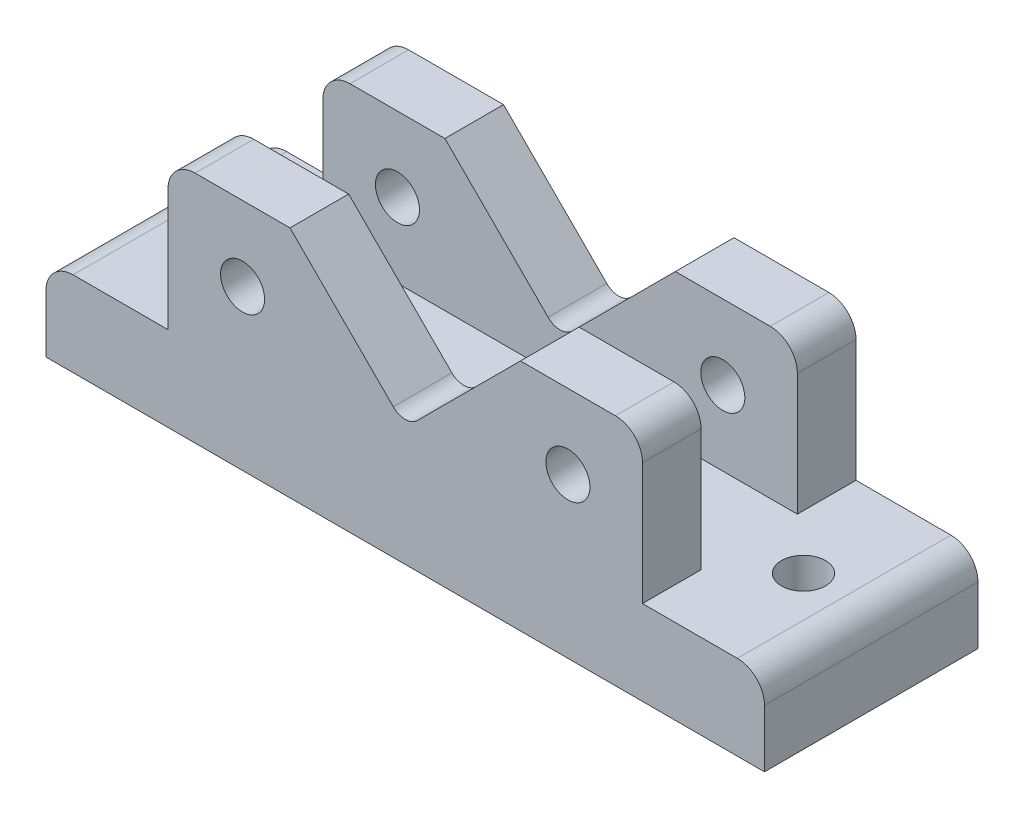
ISO-10303-21;
HEADER;
FILE_DESCRIPTION(('STEP AP214'),'2;1');
FILE_NAME('part.step','',(''),(''),'','','');
FILE_SCHEMA(('AUTOMOTIVE_DESIGN { 1 0 10303 214 1 1 1 1 }'));
ENDSEC;
DATA;
#1=APPLICATION_CONTEXT('core data for automotive mechanical design processes');
#2=APPLICATION_PROTOCOL_DEFINITION('international standard','automotive_design',2000,#1);
#3=PRODUCT_CONTEXT('',#1,'mechanical');
#4=PRODUCT('Part','Part','',(#3));
#5=PRODUCT_RELATED_PRODUCT_CATEGORY('part','',(#4));
#6=PRODUCT_DEFINITION_FORMATION('','',#4);
#7=PRODUCT_DEFINITION_CONTEXT('part definition',#1,'design');
#8=PRODUCT_DEFINITION('design','',#6,#7);
#9=PRODUCT_DEFINITION_SHAPE('','',#8);
#10=(LENGTH_UNIT() NAMED_UNIT(*) SI_UNIT(.MILLI.,.METRE.));
#11=(NAMED_UNIT(*) PLANE_ANGLE_UNIT() SI_UNIT($,.RADIAN.));
#12=(NAMED_UNIT(*) SI_UNIT($,.STERADIAN.) SOLID_ANGLE_UNIT());
#13=UNCERTAINTY_MEASURE_WITH_UNIT(LENGTH_MEASURE(1.E-05),#10,'distance_accuracy_value','');
#14=(GEOMETRIC_REPRESENTATION_CONTEXT(3) GLOBAL_UNCERTAINTY_ASSIGNED_CONTEXT((#13)) GLOBAL_UNIT_ASSIGNED_CONTEXT((#10,
#11,#12)) REPRESENTATION_CONTEXT('',''));
#15=CARTESIAN_POINT('',(0.,0.,0.));
#16=DIRECTION('',(0.,0.,1.));
#17=DIRECTION('',(1.,0.,0.));
#18=AXIS2_PLACEMENT_3D('',#15,#16,#17);
#19=CARTESIAN_POINT('',(0.,25.,0.));
#20=DIRECTION('',(0.,1.,0.));
#21=DIRECTION('',(0.,0.,1.));
#22=AXIS2_PLACEMENT_3D('',#19,#20,#21);
#23=PLANE('',#22);
#24=CARTESIAN_POINT('',(86.,25.,0.));
#25=DIRECTION('',(0.,1.,0.));
#26=DIRECTION('',(0.,0.,1.));
#27=AXIS2_PLACEMENT_3D('',#24,#25,#26);
#28=CIRCLE('',#27,6.5);
#29=CARTESIAN_POINT('',(86.,25.,6.5));
#30=VERTEX_POINT('',#29);
#31=EDGE_CURVE('E433',#30,#30,#28,.T.);
#32=ORIENTED_EDGE('',*,*,#31,.F.);
#33=EDGE_LOOP('',(#32));
#34=FACE_BOUND('',#33,.T.);
#35=CARTESIAN_POINT('',(-86.,25.,1.50704724731259E-13));
#36=DIRECTION('',(0.,1.,0.));
#37=DIRECTION('',(0.,0.,-1.));
#38=AXIS2_PLACEMENT_3D('',#35,#36,#37);
#39=CIRCLE('',#38,6.5);
#40=CARTESIAN_POINT('',(-86.,25.,-6.49999999999985));
#41=VERTEX_POINT('',#40);
#42=EDGE_CURVE('E425',#41,#41,#39,.T.);
#43=ORIENTED_EDGE('',*,*,#42,.F.);
#44=EDGE_LOOP('',(#43));
#45=FACE_BOUND('',#44,.T.);
#46=DIRECTION('',(-1.,0.,0.));
#47=VECTOR('',#46,1.);
#48=CARTESIAN_POINT('',(-106.,25.,-31.5));
#49=LINE('',#48,#47);
#50=CARTESIAN_POINT('',(-70.,25.,-31.5));
#51=VERTEX_POINT('',#50);
#52=CARTESIAN_POINT('',(-98.,25.,-31.5));
#53=VERTEX_POINT('',#52);
#54=EDGE_CURVE('E445',#51,#53,#49,.T.);
#55=ORIENTED_EDGE('',*,*,#54,.T.);
#56=DIRECTION('',(0.,0.,1.));
#57=VECTOR('',#56,1.);
#58=CARTESIAN_POINT('',(-98.,25.,31.5));
#59=LINE('',#58,#57);
#60=CARTESIAN_POINT('',(-98.,25.,31.5));
#61=VERTEX_POINT('',#60);
#62=EDGE_CURVE('E480',#53,#61,#59,.T.);
#63=ORIENTED_EDGE('',*,*,#62,.T.);
#64=DIRECTION('',(1.,0.,0.));
#65=VECTOR('',#64,1.);
#66=CARTESIAN_POINT('',(-106.,25.,31.5));
#67=LINE('',#66,#65);
#68=CARTESIAN_POINT('',(-70.,25.,31.5));
#69=VERTEX_POINT('',#68);
#70=EDGE_CURVE('E446',#61,#69,#67,.T.);
#71=ORIENTED_EDGE('',*,*,#70,.T.);
#72=DIRECTION('',(0.,0.,1.));
#73=VECTOR('',#72,1.);
#74=CARTESIAN_POINT('',(-70.,25.,14.2));
#75=LINE('',#74,#73);
#76=CARTESIAN_POINT('',(-70.,25.,14.2));
#77=VERTEX_POINT('',#76);
#78=EDGE_CURVE('E368',#77,#69,#75,.T.);
#79=ORIENTED_EDGE('',*,*,#78,.F.);
#80=DIRECTION('',(1.,0.,0.));
#81=VECTOR('',#80,1.);
#82=CARTESIAN_POINT('',(-70.,25.,14.2));
#83=LINE('',#82,#81);
#84=CARTESIAN_POINT('',(70.,25.,14.2));
#85=VERTEX_POINT('',#84);
#86=EDGE_CURVE('E336',#77,#85,#83,.T.);
#87=ORIENTED_EDGE('',*,*,#86,.T.);
#88=DIRECTION('',(0.,0.,1.));
#89=VECTOR('',#88,1.);
#90=CARTESIAN_POINT('',(70.,25.,14.2));
#91=LINE('',#90,#89);
#92=CARTESIAN_POINT('',(70.,25.,31.5));
#93=VERTEX_POINT('',#92);
#94=EDGE_CURVE('E418',#85,#93,#91,.T.);
#95=ORIENTED_EDGE('',*,*,#94,.T.);
#96=CARTESIAN_POINT('',(98.,25.,31.5));
#97=VERTEX_POINT('',#96);
#98=EDGE_CURVE('E444',#93,#97,#67,.T.);
#99=ORIENTED_EDGE('',*,*,#98,.T.);
#100=DIRECTION('',(0.,0.,-1.));
#101=VECTOR('',#100,1.);
#102=CARTESIAN_POINT('',(98.,25.,-31.5));
#103=LINE('',#102,#101);
#104=CARTESIAN_POINT('',(98.,25.,-31.5));
#105=VERTEX_POINT('',#104);
#106=EDGE_CURVE('E476',#97,#105,#103,.T.);
#107=ORIENTED_EDGE('',*,*,#106,.T.);
#108=CARTESIAN_POINT('',(70.,25.,-31.5));
#109=VERTEX_POINT('',#108);
#110=EDGE_CURVE('E441',#105,#109,#49,.T.);
#111=ORIENTED_EDGE('',*,*,#110,.T.);
#112=DIRECTION('',(0.,0.,-1.));
#113=VECTOR('',#112,1.);
#114=CARTESIAN_POINT('',(70.,25.,-14.2));
#115=LINE('',#114,#113);
#116=CARTESIAN_POINT('',(70.,25.,-14.2));
#117=VERTEX_POINT('',#116);
#118=EDGE_CURVE('E294',#117,#109,#115,.T.);
#119=ORIENTED_EDGE('',*,*,#118,.F.);
#120=DIRECTION('',(1.,0.,0.));
#121=VECTOR('',#120,1.);
#122=CARTESIAN_POINT('',(-70.,25.,-14.2));
#123=LINE('',#122,#121);
#124=CARTESIAN_POINT('',(-70.,25.,-14.2));
#125=VERTEX_POINT('',#124);
#126=EDGE_CURVE('E237',#125,#117,#123,.T.);
#127=ORIENTED_EDGE('',*,*,#126,.F.);
#128=DIRECTION('',(0.,0.,-1.));
#129=VECTOR('',#128,1.);
#130=CARTESIAN_POINT('',(-70.,25.,-14.2));
#131=LINE('',#130,#129);
#132=EDGE_CURVE('E241',#125,#51,#131,.T.);
#133=ORIENTED_EDGE('',*,*,#132,.T.);
#134=EDGE_LOOP('',(#55,#63,#71,#79,#87,#95,#99,#107,#111,#119,#127,#133));
#135=FACE_BOUND('',#134,.T.);
#136=ADVANCED_FACE('F38',(#34,#45,#135),#23,.T.);
#137=CARTESIAN_POINT('',(0.,0.,0.));
#138=DIRECTION('',(0.,1.,0.));
#139=DIRECTION('',(0.,0.,1.));
#140=AXIS2_PLACEMENT_3D('',#137,#138,#139);
#141=PLANE('',#140);
#142=DIRECTION('',(0.,0.,-1.));
#143=VECTOR('',#142,1.);
#144=CARTESIAN_POINT('',(106.,0.,-31.5));
#145=LINE('',#144,#143);
#146=CARTESIAN_POINT('',(106.,0.,31.5));
#147=VERTEX_POINT('',#146);
#148=CARTESIAN_POINT('',(106.,0.,-31.5));
#149=VERTEX_POINT('',#148);
#150=EDGE_CURVE('E437',#147,#149,#145,.T.);
#151=ORIENTED_EDGE('',*,*,#150,.F.);
#152=DIRECTION('',(1.,0.,0.));
#153=VECTOR('',#152,1.);
#154=CARTESIAN_POINT('',(-106.,0.,31.5));
#155=LINE('',#154,#153);
#156=CARTESIAN_POINT('',(-106.,0.,31.5));
#157=VERTEX_POINT('',#156);
#158=EDGE_CURVE('E461',#157,#147,#155,.T.);
#159=ORIENTED_EDGE('',*,*,#158,.F.);
#160=DIRECTION('',(0.,0.,1.));
#161=VECTOR('',#160,1.);
#162=CARTESIAN_POINT('',(-106.,0.,-31.5));
#163=LINE('',#162,#161);
#164=CARTESIAN_POINT('',(-106.,0.,-31.5));
#165=VERTEX_POINT('',#164);
#166=EDGE_CURVE('E457',#165,#157,#163,.T.);
#167=ORIENTED_EDGE('',*,*,#166,.F.);
#168=DIRECTION('',(-1.,0.,0.));
#169=VECTOR('',#168,1.);
#170=CARTESIAN_POINT('',(-106.,0.,-31.5));
#171=LINE('',#170,#169);
#172=EDGE_CURVE('E453',#149,#165,#171,.T.);
#173=ORIENTED_EDGE('',*,*,#172,.F.);
#174=EDGE_LOOP('',(#151,#159,#167,#173));
#175=FACE_BOUND('',#174,.T.);
#176=CARTESIAN_POINT('',(86.,0.,0.));
#177=DIRECTION('',(0.,1.,0.));
#178=DIRECTION('',(0.,0.,1.));
#179=AXIS2_PLACEMENT_3D('',#176,#177,#178);
#180=CIRCLE('',#179,6.5);
#181=CARTESIAN_POINT('',(86.,0.,6.5));
#182=VERTEX_POINT('',#181);
#183=EDGE_CURVE('E429',#182,#182,#180,.T.);
#184=ORIENTED_EDGE('',*,*,#183,.T.);
#185=EDGE_LOOP('',(#184));
#186=FACE_BOUND('',#185,.T.);
#187=CARTESIAN_POINT('',(-86.,0.,1.50704724731259E-13));
#188=DIRECTION('',(0.,1.,0.));
#189=DIRECTION('',(0.,0.,-1.));
#190=AXIS2_PLACEMENT_3D('',#187,#188,#189);
#191=CIRCLE('',#190,6.5);
#192=CARTESIAN_POINT('',(-86.,0.,-6.49999999999985));
#193=VERTEX_POINT('',#192);
#194=EDGE_CURVE('E401',#193,#193,#191,.T.);
#195=ORIENTED_EDGE('',*,*,#194,.T.);
#196=EDGE_LOOP('',(#195));
#197=FACE_BOUND('',#196,.T.);
#198=ADVANCED_FACE('F544',(#175,#186,#197),#141,.F.);
#199=CARTESIAN_POINT('',(106.,25.,-31.5));
#200=DIRECTION('',(-1.,0.,0.));
#201=DIRECTION('',(0.,0.,1.));
#202=AXIS2_PLACEMENT_3D('',#199,#200,#201);
#203=PLANE('',#202);
#204=DIRECTION('',(0.,-1.,0.));
#205=VECTOR('',#204,1.);
#206=CARTESIAN_POINT('',(106.,25.,-31.5));
#207=LINE('',#206,#205);
#208=CARTESIAN_POINT('',(106.,17.,-31.5));
#209=VERTEX_POINT('',#208);
#210=EDGE_CURVE('E473',#209,#149,#207,.T.);
#211=ORIENTED_EDGE('',*,*,#210,.F.);
#212=DIRECTION('',(0.,0.,-1.));
#213=VECTOR('',#212,1.);
#214=CARTESIAN_POINT('',(106.,17.,31.5));
#215=LINE('',#214,#213);
#216=CARTESIAN_POINT('',(106.,17.,31.5));
#217=VERTEX_POINT('',#216);
#218=EDGE_CURVE('E499',#209,#217,#215,.F.);
#219=ORIENTED_EDGE('',*,*,#218,.T.);
#220=DIRECTION('',(0.,-1.,0.));
#221=VECTOR('',#220,1.);
#222=CARTESIAN_POINT('',(106.,25.,31.5));
#223=LINE('',#222,#221);
#224=EDGE_CURVE('E449',#217,#147,#223,.T.);
#225=ORIENTED_EDGE('',*,*,#224,.T.);
#226=ORIENTED_EDGE('',*,*,#150,.T.);
#227=EDGE_LOOP('',(#211,#219,#225,#226));
#228=FACE_BOUND('',#227,.T.);
#229=ADVANCED_FACE('F592',(#228),#203,.F.);
#230=CARTESIAN_POINT('',(-106.,25.,-31.5));
#231=DIRECTION('',(0.,0.,1.));
#232=DIRECTION('',(1.,0.,0.));
#233=AXIS2_PLACEMENT_3D('',#230,#231,#232);
#234=PLANE('',#233);
#235=DIRECTION('',(0.,-1.,0.));
#236=VECTOR('',#235,1.);
#237=CARTESIAN_POINT('',(-106.,25.,-31.5));
#238=LINE('',#237,#236);
#239=CARTESIAN_POINT('',(-106.,17.,-31.5));
#240=VERTEX_POINT('',#239);
#241=EDGE_CURVE('E470',#240,#165,#238,.T.);
#242=ORIENTED_EDGE('',*,*,#241,.F.);
#243=CARTESIAN_POINT('',(-98.,17.,-31.5));
#244=DIRECTION('',(0.,0.,1.));
#245=DIRECTION('',(1.,0.,0.));
#246=AXIS2_PLACEMENT_3D('',#243,#244,#245);
#247=CIRCLE('',#246,8.);
#248=EDGE_CURVE('E496',#240,#53,#247,.F.);
#249=ORIENTED_EDGE('',*,*,#248,.T.);
#250=ORIENTED_EDGE('',*,*,#54,.F.);
#251=DIRECTION('',(0.,-1.,0.));
#252=VECTOR('',#251,1.);
#253=CARTESIAN_POINT('',(-70.,25.,-31.5));
#254=LINE('',#253,#252);
#255=CARTESIAN_POINT('',(-70.,61.,-31.5));
#256=VERTEX_POINT('',#255);
#257=EDGE_CURVE('E271',#256,#51,#254,.T.);
#258=ORIENTED_EDGE('',*,*,#257,.F.);
#259=CARTESIAN_POINT('',(-62.,61.,-31.5));
#260=DIRECTION('',(0.,0.,1.));
#261=DIRECTION('',(1.,0.,0.));
#262=AXIS2_PLACEMENT_3D('',#259,#260,#261);
#263=CIRCLE('',#262,8.);
#264=CARTESIAN_POINT('',(-61.9999999999999,69.,-31.5));
#265=VERTEX_POINT('',#264);
#266=EDGE_CURVE('E231',#265,#256,#263,.T.);
#267=ORIENTED_EDGE('',*,*,#266,.F.);
#268=DIRECTION('',(-1.,0.,0.));
#269=VECTOR('',#268,1.);
#270=CARTESIAN_POINT('',(-61.9999999999999,69.,-31.5));
#271=LINE('',#270,#269);
#272=CARTESIAN_POINT('',(-34.,69.,-31.5));
#273=VERTEX_POINT('',#272);
#274=EDGE_CURVE('E277',#273,#265,#271,.T.);
#275=ORIENTED_EDGE('',*,*,#274,.F.);
#276=DIRECTION('',(-0.707106781186544,0.707106781186551,0.));
#277=VECTOR('',#276,1.);
#278=CARTESIAN_POINT('',(-34.,69.,-31.5));
#279=LINE('',#278,#277);
#280=CARTESIAN_POINT('',(-3.53553390593276,38.5355339059324,-31.5));
#281=VERTEX_POINT('',#280);
#282=EDGE_CURVE('E280',#281,#273,#279,.T.);
#283=ORIENTED_EDGE('',*,*,#282,.F.);
#284=CARTESIAN_POINT('',(0.,42.0710678118651,-31.5));
#285=DIRECTION('',(0.,0.,1.));
#286=DIRECTION('',(1.,0.,0.));
#287=AXIS2_PLACEMENT_3D('',#284,#285,#286);
#288=CIRCLE('',#287,5.);
#289=CARTESIAN_POINT('',(3.53553390593276,38.5355339059324,-31.5));
#290=VERTEX_POINT('',#289);
#291=EDGE_CURVE('E47',#281,#290,#288,.T.);
#292=ORIENTED_EDGE('',*,*,#291,.T.);
#293=DIRECTION('',(-0.707106781186544,-0.707106781186551,0.));
#294=VECTOR('',#293,1.);
#295=CARTESIAN_POINT('',(34.,69.,-31.5));
#296=LINE('',#295,#294);
#297=CARTESIAN_POINT('',(34.,69.,-31.5));
#298=VERTEX_POINT('',#297);
#299=EDGE_CURVE('E283',#298,#290,#296,.T.);
#300=ORIENTED_EDGE('',*,*,#299,.F.);
#301=DIRECTION('',(-1.,0.,0.));
#302=VECTOR('',#301,1.);
#303=CARTESIAN_POINT('',(61.9999999999999,69.,-31.5));
#304=LINE('',#303,#302);
#305=CARTESIAN_POINT('',(61.9999999999999,69.,-31.5));
#306=VERTEX_POINT('',#305);
#307=EDGE_CURVE('E286',#306,#298,#304,.T.);
#308=ORIENTED_EDGE('',*,*,#307,.F.);
#309=CARTESIAN_POINT('',(62.,61.,-31.5));
#310=DIRECTION('',(0.,0.,1.));
#311=DIRECTION('',(-1.,0.,0.));
#312=AXIS2_PLACEMENT_3D('',#309,#310,#311);
#313=CIRCLE('',#312,8.);
#314=CARTESIAN_POINT('',(70.,61.,-31.5));
#315=VERTEX_POINT('',#314);
#316=EDGE_CURVE('E246',#315,#306,#313,.T.);
#317=ORIENTED_EDGE('',*,*,#316,.F.);
#318=DIRECTION('',(0.,1.,0.));
#319=VECTOR('',#318,1.);
#320=CARTESIAN_POINT('',(70.,25.,-31.5));
#321=LINE('',#320,#319);
#322=EDGE_CURVE('E243',#109,#315,#321,.T.);
#323=ORIENTED_EDGE('',*,*,#322,.F.);
#324=ORIENTED_EDGE('',*,*,#110,.F.);
#325=CARTESIAN_POINT('',(98.,17.,-31.5));
#326=DIRECTION('',(0.,0.,1.));
#327=DIRECTION('',(1.,0.,0.));
#328=AXIS2_PLACEMENT_3D('',#325,#326,#327);
#329=CIRCLE('',#328,8.);
#330=EDGE_CURVE('E493',#105,#209,#329,.F.);
#331=ORIENTED_EDGE('',*,*,#330,.T.);
#332=ORIENTED_EDGE('',*,*,#210,.T.);
#333=ORIENTED_EDGE('',*,*,#172,.T.);
#334=EDGE_LOOP('',(#242,#249,#250,#258,#267,#275,#283,#292,#300,#308,#317,#323,#324,#331,#332,#333));
#335=FACE_BOUND('',#334,.T.);
#336=CARTESIAN_POINT('',(-48.,47.,-31.5));
#337=DIRECTION('',(0.,0.,1.));
#338=DIRECTION('',(1.,0.,0.));
#339=AXIS2_PLACEMENT_3D('',#336,#337,#338);
#340=CIRCLE('',#339,6.5);
#341=CARTESIAN_POINT('',(-41.5,47.,-31.5));
#342=VERTEX_POINT('',#341);
#343=EDGE_CURVE('E249',#342,#342,#340,.T.);
#344=ORIENTED_EDGE('',*,*,#343,.T.);
#345=EDGE_LOOP('',(#344));
#346=FACE_BOUND('',#345,.T.);
#347=CARTESIAN_POINT('',(48.,47.,-31.5));
#348=DIRECTION('',(0.,0.,1.));
#349=DIRECTION('',(-1.,0.,0.));
#350=AXIS2_PLACEMENT_3D('',#347,#348,#349);
#351=CIRCLE('',#350,6.5);
#352=CARTESIAN_POINT('',(41.5,47.,-31.5));
#353=VERTEX_POINT('',#352);
#354=EDGE_CURVE('E933',#353,#353,#351,.T.);
#355=ORIENTED_EDGE('',*,*,#354,.T.);
#356=EDGE_LOOP('',(#355));
#357=FACE_BOUND('',#356,.T.);
#358=ADVANCED_FACE('F556',(#335,#346,#357),#234,.F.);
#359=CARTESIAN_POINT('',(-106.,25.,-31.5));
#360=DIRECTION('',(1.,0.,0.));
#361=DIRECTION('',(0.,0.,-1.));
#362=AXIS2_PLACEMENT_3D('',#359,#360,#361);
#363=PLANE('',#362);
#364=DIRECTION('',(0.,-1.,0.));
#365=VECTOR('',#364,1.);
#366=CARTESIAN_POINT('',(-106.,25.,31.5));
#367=LINE('',#366,#365);
#368=CARTESIAN_POINT('',(-106.,17.,31.5));
#369=VERTEX_POINT('',#368);
#370=EDGE_CURVE('E467',#369,#157,#367,.T.);
#371=ORIENTED_EDGE('',*,*,#370,.F.);
#372=DIRECTION('',(0.,0.,1.));
#373=VECTOR('',#372,1.);
#374=CARTESIAN_POINT('',(-106.,17.,-31.5));
#375=LINE('',#374,#373);
#376=EDGE_CURVE('E490',#369,#240,#375,.F.);
#377=ORIENTED_EDGE('',*,*,#376,.T.);
#378=ORIENTED_EDGE('',*,*,#241,.T.);
#379=ORIENTED_EDGE('',*,*,#166,.T.);
#380=EDGE_LOOP('',(#371,#377,#378,#379));
#381=FACE_BOUND('',#380,.T.);
#382=ADVANCED_FACE('F537',(#381),#363,.F.);
#383=CARTESIAN_POINT('',(-106.,25.,31.5));
#384=DIRECTION('',(0.,0.,-1.));
#385=DIRECTION('',(-1.,0.,0.));
#386=AXIS2_PLACEMENT_3D('',#383,#384,#385);
#387=PLANE('',#386);
#388=ORIENTED_EDGE('',*,*,#70,.F.);
#389=CARTESIAN_POINT('',(-98.,17.,31.5));
#390=DIRECTION('',(0.,0.,-1.));
#391=DIRECTION('',(-1.,0.,0.));
#392=AXIS2_PLACEMENT_3D('',#389,#390,#391);
#393=CIRCLE('',#392,8.);
#394=EDGE_CURVE('E487',#61,#369,#393,.F.);
#395=ORIENTED_EDGE('',*,*,#394,.T.);
#396=ORIENTED_EDGE('',*,*,#370,.T.);
#397=ORIENTED_EDGE('',*,*,#158,.T.);
#398=ORIENTED_EDGE('',*,*,#224,.F.);
#399=CARTESIAN_POINT('',(98.,17.,31.5));
#400=DIRECTION('',(0.,0.,-1.));
#401=DIRECTION('',(-1.,0.,0.));
#402=AXIS2_PLACEMENT_3D('',#399,#400,#401);
#403=CIRCLE('',#402,8.);
#404=EDGE_CURVE('E484',#217,#97,#403,.F.);
#405=ORIENTED_EDGE('',*,*,#404,.T.);
#406=ORIENTED_EDGE('',*,*,#98,.F.);
#407=DIRECTION('',(0.,1.,0.));
#408=VECTOR('',#407,1.);
#409=CARTESIAN_POINT('',(70.,25.,31.5));
#410=LINE('',#409,#408);
#411=CARTESIAN_POINT('',(70.,61.,31.5));
#412=VERTEX_POINT('',#411);
#413=EDGE_CURVE('E372',#93,#412,#410,.T.);
#414=ORIENTED_EDGE('',*,*,#413,.T.);
#415=CARTESIAN_POINT('',(62.,61.,31.5));
#416=DIRECTION('',(0.,0.,1.));
#417=DIRECTION('',(-1.,0.,0.));
#418=AXIS2_PLACEMENT_3D('',#415,#416,#417);
#419=CIRCLE('',#418,8.);
#420=CARTESIAN_POINT('',(61.9999999999999,69.,31.5));
#421=VERTEX_POINT('',#420);
#422=EDGE_CURVE('E376',#412,#421,#419,.T.);
#423=ORIENTED_EDGE('',*,*,#422,.T.);
#424=DIRECTION('',(-1.,0.,0.));
#425=VECTOR('',#424,1.);
#426=CARTESIAN_POINT('',(61.9999999999999,69.,31.5));
#427=LINE('',#426,#425);
#428=CARTESIAN_POINT('',(34.,69.,31.5));
#429=VERTEX_POINT('',#428);
#430=EDGE_CURVE('E380',#421,#429,#427,.T.);
#431=ORIENTED_EDGE('',*,*,#430,.T.);
#432=DIRECTION('',(-0.707106781186544,-0.707106781186551,0.));
#433=VECTOR('',#432,1.);
#434=CARTESIAN_POINT('',(34.,69.,31.5));
#435=LINE('',#434,#433);
#436=CARTESIAN_POINT('',(3.53553390593276,38.5355339059324,31.5));
#437=VERTEX_POINT('',#436);
#438=EDGE_CURVE('E384',#429,#437,#435,.T.);
#439=ORIENTED_EDGE('',*,*,#438,.T.);
#440=CARTESIAN_POINT('',(0.,42.0710678118651,31.5));
#441=DIRECTION('',(0.,0.,-1.));
#442=DIRECTION('',(-1.,0.,0.));
#443=AXIS2_PLACEMENT_3D('',#440,#441,#442);
#444=CIRCLE('',#443,5.);
#445=CARTESIAN_POINT('',(-3.53553390593276,38.5355339059324,31.5));
#446=VERTEX_POINT('',#445);
#447=EDGE_CURVE('E515',#437,#446,#444,.T.);
#448=ORIENTED_EDGE('',*,*,#447,.T.);
#449=DIRECTION('',(-0.707106781186544,0.707106781186551,0.));
#450=VECTOR('',#449,1.);
#451=CARTESIAN_POINT('',(-34.,69.,31.5));
#452=LINE('',#451,#450);
#453=CARTESIAN_POINT('',(-34.,69.,31.5));
#454=VERTEX_POINT('',#453);
#455=EDGE_CURVE('E388',#446,#454,#452,.T.);
#456=ORIENTED_EDGE('',*,*,#455,.T.);
#457=DIRECTION('',(-1.,0.,0.));
#458=VECTOR('',#457,1.);
#459=CARTESIAN_POINT('',(-61.9999999999999,69.,31.5));
#460=LINE('',#459,#458);
#461=CARTESIAN_POINT('',(-61.9999999999999,69.,31.5));
#462=VERTEX_POINT('',#461);
#463=EDGE_CURVE('E391',#454,#462,#460,.T.);
#464=ORIENTED_EDGE('',*,*,#463,.T.);
#465=CARTESIAN_POINT('',(-62.,61.,31.5));
#466=DIRECTION('',(0.,0.,1.));
#467=DIRECTION('',(1.,0.,0.));
#468=AXIS2_PLACEMENT_3D('',#465,#466,#467);
#469=CIRCLE('',#468,8.);
#470=CARTESIAN_POINT('',(-70.,61.,31.5));
#471=VERTEX_POINT('',#470);
#472=EDGE_CURVE('E337',#462,#471,#469,.T.);
#473=ORIENTED_EDGE('',*,*,#472,.T.);
#474=DIRECTION('',(0.,-1.,0.));
#475=VECTOR('',#474,1.);
#476=CARTESIAN_POINT('',(-70.,25.,31.5));
#477=LINE('',#476,#475);
#478=EDGE_CURVE('E328',#471,#69,#477,.T.);
#479=ORIENTED_EDGE('',*,*,#478,.T.);
#480=EDGE_LOOP('',(#388,#395,#396,#397,#398,#405,#406,#414,#423,#431,#439,#448,#456,#464,#473,#479));
#481=FACE_BOUND('',#480,.T.);
#482=CARTESIAN_POINT('',(48.,47.,31.5));
#483=DIRECTION('',(0.,0.,1.));
#484=DIRECTION('',(-1.,0.,0.));
#485=AXIS2_PLACEMENT_3D('',#482,#483,#484);
#486=CIRCLE('',#485,6.5);
#487=CARTESIAN_POINT('',(41.5,47.,31.5));
#488=VERTEX_POINT('',#487);
#489=EDGE_CURVE('E293',#488,#488,#486,.T.);
#490=ORIENTED_EDGE('',*,*,#489,.F.);
#491=EDGE_LOOP('',(#490));
#492=FACE_BOUND('',#491,.T.);
#493=CARTESIAN_POINT('',(-48.,47.,31.5));
#494=DIRECTION('',(0.,0.,1.));
#495=DIRECTION('',(1.,0.,0.));
#496=AXIS2_PLACEMENT_3D('',#493,#494,#495);
#497=CIRCLE('',#496,6.5);
#498=CARTESIAN_POINT('',(-41.5,47.,31.5));
#499=VERTEX_POINT('',#498);
#500=EDGE_CURVE('E320',#499,#499,#497,.T.);
#501=ORIENTED_EDGE('',*,*,#500,.F.);
#502=EDGE_LOOP('',(#501));
#503=FACE_BOUND('',#502,.T.);
#504=ADVANCED_FACE('F534',(#481,#492,#503),#387,.F.);
#505=CARTESIAN_POINT('',(86.,25.,0.));
#506=DIRECTION('',(0.,-1.,0.));
#507=DIRECTION('',(0.,0.,-1.));
#508=AXIS2_PLACEMENT_3D('',#505,#506,#507);
#509=CYLINDRICAL_SURFACE('',#508,6.5);
#510=ORIENTED_EDGE('',*,*,#31,.T.);
#511=EDGE_LOOP('',(#510));
#512=FACE_BOUND('',#511,.T.);
#513=ORIENTED_EDGE('',*,*,#183,.F.);
#514=EDGE_LOOP('',(#513));
#515=FACE_BOUND('',#514,.T.);
#516=ADVANCED_FACE('F597',(#512,#515),#509,.F.);
#517=CARTESIAN_POINT('',(-86.,25.,1.50704724731259E-13));
#518=DIRECTION('',(0.,-1.,0.));
#519=DIRECTION('',(0.,0.,-1.));
#520=AXIS2_PLACEMENT_3D('',#517,#518,#519);
#521=CYLINDRICAL_SURFACE('',#520,6.5);
#522=ORIENTED_EDGE('',*,*,#42,.T.);
#523=EDGE_LOOP('',(#522));
#524=FACE_BOUND('',#523,.T.);
#525=ORIENTED_EDGE('',*,*,#194,.F.);
#526=EDGE_LOOP('',(#525));
#527=FACE_BOUND('',#526,.T.);
#528=ADVANCED_FACE('F674',(#524,#527),#521,.F.);
#529=CARTESIAN_POINT('',(-70.,25.,14.2));
#530=DIRECTION('',(-1.,0.,0.));
#531=DIRECTION('',(0.,-1.,0.));
#532=AXIS2_PLACEMENT_3D('',#529,#530,#531);
#533=PLANE('',#532);
#534=ORIENTED_EDGE('',*,*,#478,.F.);
#535=DIRECTION('',(0.,0.,1.));
#536=VECTOR('',#535,1.);
#537=CARTESIAN_POINT('',(-70.,61.,14.2));
#538=LINE('',#537,#536);
#539=CARTESIAN_POINT('',(-70.,61.,14.2));
#540=VERTEX_POINT('',#539);
#541=EDGE_CURVE('E398',#540,#471,#538,.T.);
#542=ORIENTED_EDGE('',*,*,#541,.F.);
#543=DIRECTION('',(0.,-1.,0.));
#544=VECTOR('',#543,1.);
#545=CARTESIAN_POINT('',(-70.,25.,14.2));
#546=LINE('',#545,#544);
#547=EDGE_CURVE('E332',#540,#77,#546,.T.);
#548=ORIENTED_EDGE('',*,*,#547,.T.);
#549=ORIENTED_EDGE('',*,*,#78,.T.);
#550=EDGE_LOOP('',(#534,#542,#548,#549));
#551=FACE_BOUND('',#550,.T.);
#552=ADVANCED_FACE('F645',(#551),#533,.T.);
#553=CARTESIAN_POINT('',(-62.,61.,14.2));
#554=DIRECTION('',(0.,0.,1.));
#555=DIRECTION('',(1.,0.,0.));
#556=AXIS2_PLACEMENT_3D('',#553,#554,#555);
#557=CYLINDRICAL_SURFACE('',#556,8.);
#558=ORIENTED_EDGE('',*,*,#472,.F.);
#559=DIRECTION('',(0.,0.,1.));
#560=VECTOR('',#559,1.);
#561=CARTESIAN_POINT('',(-61.9999999999999,69.,14.2));
#562=LINE('',#561,#560);
#563=CARTESIAN_POINT('',(-61.9999999999999,69.,14.2));
#564=VERTEX_POINT('',#563);
#565=EDGE_CURVE('E402',#564,#462,#562,.T.);
#566=ORIENTED_EDGE('',*,*,#565,.F.);
#567=CARTESIAN_POINT('',(-62.,61.,14.2));
#568=DIRECTION('',(0.,0.,1.));
#569=DIRECTION('',(1.,0.,0.));
#570=AXIS2_PLACEMENT_3D('',#567,#568,#569);
#571=CIRCLE('',#570,8.);
#572=EDGE_CURVE('E364',#564,#540,#571,.T.);
#573=ORIENTED_EDGE('',*,*,#572,.T.);
#574=ORIENTED_EDGE('',*,*,#541,.T.);
#575=EDGE_LOOP('',(#558,#566,#573,#574));
#576=FACE_BOUND('',#575,.T.);
#577=ADVANCED_FACE('F649',(#576),#557,.T.);
#578=CARTESIAN_POINT('',(-61.9999999999999,69.,14.2));
#579=DIRECTION('',(0.,1.,0.));
#580=DIRECTION('',(0.,0.,1.));
#581=AXIS2_PLACEMENT_3D('',#578,#579,#580);
#582=PLANE('',#581);
#583=ORIENTED_EDGE('',*,*,#463,.F.);
#584=DIRECTION('',(0.,0.,1.));
#585=VECTOR('',#584,1.);
#586=CARTESIAN_POINT('',(-34.,69.,14.2));
#587=LINE('',#586,#585);
#588=CARTESIAN_POINT('',(-34.,69.,14.2));
#589=VERTEX_POINT('',#588);
#590=EDGE_CURVE('E405',#589,#454,#587,.T.);
#591=ORIENTED_EDGE('',*,*,#590,.F.);
#592=DIRECTION('',(-1.,0.,0.));
#593=VECTOR('',#592,1.);
#594=CARTESIAN_POINT('',(-61.9999999999999,69.,14.2));
#595=LINE('',#594,#593);
#596=EDGE_CURVE('E360',#589,#564,#595,.T.);
#597=ORIENTED_EDGE('',*,*,#596,.T.);
#598=ORIENTED_EDGE('',*,*,#565,.T.);
#599=EDGE_LOOP('',(#583,#591,#597,#598));
#600=FACE_BOUND('',#599,.T.);
#601=ADVANCED_FACE('F653',(#600),#582,.T.);
#602=CARTESIAN_POINT('',(-34.,69.,14.2));
#603=DIRECTION('',(0.707106781186551,0.707106781186544,0.));
#604=DIRECTION('',(-0.707106781186544,0.707106781186551,0.));
#605=AXIS2_PLACEMENT_3D('',#602,#603,#604);
#606=PLANE('',#605);
#607=ORIENTED_EDGE('',*,*,#455,.F.);
#608=DIRECTION('',(0.,0.,1.));
#609=VECTOR('',#608,1.);
#610=CARTESIAN_POINT('',(-3.53553390593276,38.5355339059324,14.2));
#611=LINE('',#610,#609);
#612=CARTESIAN_POINT('',(-3.53553390593276,38.5355339059324,14.2));
#613=VERTEX_POINT('',#612);
#614=EDGE_CURVE('E506',#446,#613,#611,.F.);
#615=ORIENTED_EDGE('',*,*,#614,.T.);
#616=DIRECTION('',(-0.707106781186544,0.707106781186551,0.));
#617=VECTOR('',#616,1.);
#618=CARTESIAN_POINT('',(-34.,69.,14.2));
#619=LINE('',#618,#617);
#620=EDGE_CURVE('E357',#613,#589,#619,.T.);
#621=ORIENTED_EDGE('',*,*,#620,.T.);
#622=ORIENTED_EDGE('',*,*,#590,.T.);
#623=EDGE_LOOP('',(#607,#615,#621,#622));
#624=FACE_BOUND('',#623,.T.);
#625=ADVANCED_FACE('F656',(#624),#606,.T.);
#626=CARTESIAN_POINT('',(34.,69.,14.2));
#627=DIRECTION('',(-0.707106781186551,0.707106781186544,0.));
#628=DIRECTION('',(-0.707106781186544,-0.707106781186551,0.));
#629=AXIS2_PLACEMENT_3D('',#626,#627,#628);
#630=PLANE('',#629);
#631=DIRECTION('',(-0.707106781186544,-0.707106781186551,0.));
#632=VECTOR('',#631,1.);
#633=CARTESIAN_POINT('',(34.,69.,14.2));
#634=LINE('',#633,#632);
#635=CARTESIAN_POINT('',(34.,69.,14.2));
#636=VERTEX_POINT('',#635);
#637=CARTESIAN_POINT('',(3.53553390593276,38.5355339059324,14.2));
#638=VERTEX_POINT('',#637);
#639=EDGE_CURVE('E353',#636,#638,#634,.T.);
#640=ORIENTED_EDGE('',*,*,#639,.T.);
#641=DIRECTION('',(0.,0.,1.));
#642=VECTOR('',#641,1.);
#643=CARTESIAN_POINT('',(3.53553390593277,38.5355339059324,31.5));
#644=LINE('',#643,#642);
#645=EDGE_CURVE('E502',#638,#437,#644,.T.);
#646=ORIENTED_EDGE('',*,*,#645,.T.);
#647=ORIENTED_EDGE('',*,*,#438,.F.);
#648=DIRECTION('',(0.,0.,1.));
#649=VECTOR('',#648,1.);
#650=CARTESIAN_POINT('',(34.,69.,14.2));
#651=LINE('',#650,#649);
#652=EDGE_CURVE('E409',#636,#429,#651,.T.);
#653=ORIENTED_EDGE('',*,*,#652,.F.);
#654=EDGE_LOOP('',(#640,#646,#647,#653));
#655=FACE_BOUND('',#654,.T.);
#656=ADVANCED_FACE('F630',(#655),#630,.T.);
#657=CARTESIAN_POINT('',(61.9999999999999,69.,14.2));
#658=DIRECTION('',(0.,1.,0.));
#659=DIRECTION('',(0.,0.,1.));
#660=AXIS2_PLACEMENT_3D('',#657,#658,#659);
#661=PLANE('',#660);
#662=ORIENTED_EDGE('',*,*,#430,.F.);
#663=DIRECTION('',(0.,0.,1.));
#664=VECTOR('',#663,1.);
#665=CARTESIAN_POINT('',(61.9999999999999,69.,14.2));
#666=LINE('',#665,#664);
#667=CARTESIAN_POINT('',(61.9999999999999,69.,14.2));
#668=VERTEX_POINT('',#667);
#669=EDGE_CURVE('E412',#668,#421,#666,.T.);
#670=ORIENTED_EDGE('',*,*,#669,.F.);
#671=DIRECTION('',(-1.,0.,0.));
#672=VECTOR('',#671,1.);
#673=CARTESIAN_POINT('',(61.9999999999999,69.,14.2));
#674=LINE('',#673,#672);
#675=EDGE_CURVE('E349',#668,#636,#674,.T.);
#676=ORIENTED_EDGE('',*,*,#675,.T.);
#677=ORIENTED_EDGE('',*,*,#652,.T.);
#678=EDGE_LOOP('',(#662,#670,#676,#677));
#679=FACE_BOUND('',#678,.T.);
#680=ADVANCED_FACE('F634',(#679),#661,.T.);
#681=CARTESIAN_POINT('',(62.,61.,14.2));
#682=DIRECTION('',(0.,0.,1.));
#683=DIRECTION('',(1.,0.,0.));
#684=AXIS2_PLACEMENT_3D('',#681,#682,#683);
#685=CYLINDRICAL_SURFACE('',#684,8.);
#686=ORIENTED_EDGE('',*,*,#422,.F.);
#687=DIRECTION('',(0.,0.,1.));
#688=VECTOR('',#687,1.);
#689=CARTESIAN_POINT('',(70.,61.,14.2));
#690=LINE('',#689,#688);
#691=CARTESIAN_POINT('',(70.,61.,14.2));
#692=VERTEX_POINT('',#691);
#693=EDGE_CURVE('E415',#692,#412,#690,.T.);
#694=ORIENTED_EDGE('',*,*,#693,.F.);
#695=CARTESIAN_POINT('',(62.,61.,14.2));
#696=DIRECTION('',(0.,0.,1.));
#697=DIRECTION('',(-1.,0.,0.));
#698=AXIS2_PLACEMENT_3D('',#695,#696,#697);
#699=CIRCLE('',#698,8.);
#700=EDGE_CURVE('E345',#692,#668,#699,.T.);
#701=ORIENTED_EDGE('',*,*,#700,.T.);
#702=ORIENTED_EDGE('',*,*,#669,.T.);
#703=EDGE_LOOP('',(#686,#694,#701,#702));
#704=FACE_BOUND('',#703,.T.);
#705=ADVANCED_FACE('F639',(#704),#685,.T.);
#706=CARTESIAN_POINT('',(70.,25.,14.2));
#707=DIRECTION('',(1.,0.,0.));
#708=DIRECTION('',(0.,1.,0.));
#709=AXIS2_PLACEMENT_3D('',#706,#707,#708);
#710=PLANE('',#709);
#711=ORIENTED_EDGE('',*,*,#413,.F.);
#712=ORIENTED_EDGE('',*,*,#94,.F.);
#713=DIRECTION('',(0.,1.,0.));
#714=VECTOR('',#713,1.);
#715=CARTESIAN_POINT('',(70.,25.,14.2));
#716=LINE('',#715,#714);
#717=EDGE_CURVE('E341',#85,#692,#716,.T.);
#718=ORIENTED_EDGE('',*,*,#717,.T.);
#719=ORIENTED_EDGE('',*,*,#693,.T.);
#720=EDGE_LOOP('',(#711,#712,#718,#719));
#721=FACE_BOUND('',#720,.T.);
#722=ADVANCED_FACE('F641',(#721),#710,.T.);
#723=CARTESIAN_POINT('',(-62.,61.,14.2));
#724=DIRECTION('',(0.,0.,1.));
#725=DIRECTION('',(1.,0.,0.));
#726=AXIS2_PLACEMENT_3D('',#723,#724,#725);
#727=PLANE('',#726);
#728=CARTESIAN_POINT('',(48.,47.,14.2));
#729=DIRECTION('',(0.,0.,1.));
#730=DIRECTION('',(-1.,0.,0.));
#731=AXIS2_PLACEMENT_3D('',#728,#729,#730);
#732=CIRCLE('',#731,6.5);
#733=CARTESIAN_POINT('',(41.5,47.,14.2));
#734=VERTEX_POINT('',#733);
#735=EDGE_CURVE('E316',#734,#734,#732,.T.);
#736=ORIENTED_EDGE('',*,*,#735,.T.);
#737=EDGE_LOOP('',(#736));
#738=FACE_BOUND('',#737,.T.);
#739=CARTESIAN_POINT('',(-48.,47.,14.2));
#740=DIRECTION('',(0.,0.,1.));
#741=DIRECTION('',(1.,0.,0.));
#742=AXIS2_PLACEMENT_3D('',#739,#740,#741);
#743=CIRCLE('',#742,6.5);
#744=CARTESIAN_POINT('',(-41.5,47.,14.2));
#745=VERTEX_POINT('',#744);
#746=EDGE_CURVE('E324',#745,#745,#743,.T.);
#747=ORIENTED_EDGE('',*,*,#746,.T.);
#748=EDGE_LOOP('',(#747));
#749=FACE_BOUND('',#748,.T.);
#750=ORIENTED_EDGE('',*,*,#547,.F.);
#751=ORIENTED_EDGE('',*,*,#572,.F.);
#752=ORIENTED_EDGE('',*,*,#596,.F.);
#753=ORIENTED_EDGE('',*,*,#620,.F.);
#754=CARTESIAN_POINT('',(0.,42.0710678118651,14.2));
#755=DIRECTION('',(0.,0.,1.));
#756=DIRECTION('',(1.,0.,0.));
#757=AXIS2_PLACEMENT_3D('',#754,#755,#756);
#758=CIRCLE('',#757,5.);
#759=EDGE_CURVE('E518',#613,#638,#758,.T.);
#760=ORIENTED_EDGE('',*,*,#759,.T.);
#761=ORIENTED_EDGE('',*,*,#639,.F.);
#762=ORIENTED_EDGE('',*,*,#675,.F.);
#763=ORIENTED_EDGE('',*,*,#700,.F.);
#764=ORIENTED_EDGE('',*,*,#717,.F.);
#765=ORIENTED_EDGE('',*,*,#86,.F.);
#766=EDGE_LOOP('',(#750,#751,#752,#753,#760,#761,#762,#763,#764,#765));
#767=FACE_BOUND('',#766,.T.);
#768=ADVANCED_FACE('F626',(#738,#749,#767),#727,.F.);
#769=CARTESIAN_POINT('',(-48.,47.,14.2));
#770=DIRECTION('',(0.,0.,1.));
#771=DIRECTION('',(1.,0.,0.));
#772=AXIS2_PLACEMENT_3D('',#769,#770,#771);
#773=CYLINDRICAL_SURFACE('',#772,6.5);
#774=ORIENTED_EDGE('',*,*,#746,.F.);
#775=EDGE_LOOP('',(#774));
#776=FACE_BOUND('',#775,.T.);
#777=ORIENTED_EDGE('',*,*,#500,.T.);
#778=EDGE_LOOP('',(#777));
#779=FACE_BOUND('',#778,.T.);
#780=ADVANCED_FACE('F779',(#776,#779),#773,.F.);
#781=CARTESIAN_POINT('',(48.,47.,14.2));
#782=DIRECTION('',(0.,0.,1.));
#783=DIRECTION('',(1.,0.,0.));
#784=AXIS2_PLACEMENT_3D('',#781,#782,#783);
#785=CYLINDRICAL_SURFACE('',#784,6.5);
#786=ORIENTED_EDGE('',*,*,#735,.F.);
#787=EDGE_LOOP('',(#786));
#788=FACE_BOUND('',#787,.T.);
#789=ORIENTED_EDGE('',*,*,#489,.T.);
#790=EDGE_LOOP('',(#789));
#791=FACE_BOUND('',#790,.T.);
#792=ADVANCED_FACE('F784',(#788,#791),#785,.F.);
#793=CARTESIAN_POINT('',(-62.,61.,-14.2));
#794=DIRECTION('',(0.,0.,-1.));
#795=DIRECTION('',(1.,0.,0.));
#796=AXIS2_PLACEMENT_3D('',#793,#794,#795);
#797=PLANE('',#796);
#798=DIRECTION('',(0.,-1.,0.));
#799=VECTOR('',#798,1.);
#800=CARTESIAN_POINT('',(-70.,25.,-14.2));
#801=LINE('',#800,#799);
#802=CARTESIAN_POINT('',(-70.,61.,-14.2));
#803=VERTEX_POINT('',#802);
#804=EDGE_CURVE('E218',#803,#125,#801,.T.);
#805=ORIENTED_EDGE('',*,*,#804,.T.);
#806=ORIENTED_EDGE('',*,*,#126,.T.);
#807=DIRECTION('',(0.,1.,0.));
#808=VECTOR('',#807,1.);
#809=CARTESIAN_POINT('',(70.,25.,-14.2));
#810=LINE('',#809,#808);
#811=CARTESIAN_POINT('',(70.,61.,-14.2));
#812=VERTEX_POINT('',#811);
#813=EDGE_CURVE('E266',#117,#812,#810,.T.);
#814=ORIENTED_EDGE('',*,*,#813,.T.);
#815=CARTESIAN_POINT('',(62.,61.,-14.2));
#816=DIRECTION('',(0.,0.,1.));
#817=DIRECTION('',(-1.,0.,0.));
#818=AXIS2_PLACEMENT_3D('',#815,#816,#817);
#819=CIRCLE('',#818,8.);
#820=CARTESIAN_POINT('',(61.9999999999999,69.,-14.2));
#821=VERTEX_POINT('',#820);
#822=EDGE_CURVE('E263',#812,#821,#819,.T.);
#823=ORIENTED_EDGE('',*,*,#822,.T.);
#824=DIRECTION('',(-1.,0.,0.));
#825=VECTOR('',#824,1.);
#826=CARTESIAN_POINT('',(61.9999999999999,69.,-14.2));
#827=LINE('',#826,#825);
#828=CARTESIAN_POINT('',(34.,69.,-14.2));
#829=VERTEX_POINT('',#828);
#830=EDGE_CURVE('E260',#821,#829,#827,.T.);
#831=ORIENTED_EDGE('',*,*,#830,.T.);
#832=DIRECTION('',(-0.707106781186544,-0.707106781186551,0.));
#833=VECTOR('',#832,1.);
#834=CARTESIAN_POINT('',(34.,69.,-14.2));
#835=LINE('',#834,#833);
#836=CARTESIAN_POINT('',(3.53553390593276,38.5355339059324,-14.2));
#837=VERTEX_POINT('',#836);
#838=EDGE_CURVE('E257',#829,#837,#835,.T.);
#839=ORIENTED_EDGE('',*,*,#838,.T.);
#840=CARTESIAN_POINT('',(0.,42.0710678118651,-14.2));
#841=DIRECTION('',(0.,0.,-1.));
#842=DIRECTION('',(-1.,0.,0.));
#843=AXIS2_PLACEMENT_3D('',#840,#841,#842);
#844=CIRCLE('',#843,5.);
#845=CARTESIAN_POINT('',(-3.53553390593276,38.5355339059324,-14.2));
#846=VERTEX_POINT('',#845);
#847=EDGE_CURVE('E11',#837,#846,#844,.T.);
#848=ORIENTED_EDGE('',*,*,#847,.T.);
#849=DIRECTION('',(-0.707106781186544,0.707106781186551,0.));
#850=VECTOR('',#849,1.);
#851=CARTESIAN_POINT('',(-34.,69.,-14.2));
#852=LINE('',#851,#850);
#853=CARTESIAN_POINT('',(-34.,69.,-14.2));
#854=VERTEX_POINT('',#853);
#855=EDGE_CURVE('E254',#846,#854,#852,.T.);
#856=ORIENTED_EDGE('',*,*,#855,.T.);
#857=DIRECTION('',(-1.,0.,0.));
#858=VECTOR('',#857,1.);
#859=CARTESIAN_POINT('',(-61.9999999999999,69.,-14.2));
#860=LINE('',#859,#858);
#861=CARTESIAN_POINT('',(-61.9999999999999,69.,-14.2));
#862=VERTEX_POINT('',#861);
#863=EDGE_CURVE('E221',#854,#862,#860,.T.);
#864=ORIENTED_EDGE('',*,*,#863,.T.);
#865=CARTESIAN_POINT('',(-62.,61.,-14.2));
#866=DIRECTION('',(0.,0.,1.));
#867=DIRECTION('',(1.,0.,0.));
#868=AXIS2_PLACEMENT_3D('',#865,#866,#867);
#869=CIRCLE('',#868,8.);
#870=EDGE_CURVE('E212',#862,#803,#869,.T.);
#871=ORIENTED_EDGE('',*,*,#870,.T.);
#872=EDGE_LOOP('',(#805,#806,#814,#823,#831,#839,#848,#856,#864,#871));
#873=FACE_BOUND('',#872,.T.);
#874=CARTESIAN_POINT('',(-48.,47.,-14.2));
#875=DIRECTION('',(0.,0.,1.));
#876=DIRECTION('',(1.,0.,0.));
#877=AXIS2_PLACEMENT_3D('',#874,#875,#876);
#878=CIRCLE('',#877,6.5);
#879=CARTESIAN_POINT('',(-41.5,47.,-14.2));
#880=VERTEX_POINT('',#879);
#881=EDGE_CURVE('E274',#880,#880,#878,.T.);
#882=ORIENTED_EDGE('',*,*,#881,.F.);
#883=EDGE_LOOP('',(#882));
#884=FACE_BOUND('',#883,.T.);
#885=CARTESIAN_POINT('',(48.,47.,-14.2));
#886=DIRECTION('',(0.,0.,1.));
#887=DIRECTION('',(-1.,0.,0.));
#888=AXIS2_PLACEMENT_3D('',#885,#886,#887);
#889=CIRCLE('',#888,6.5);
#890=CARTESIAN_POINT('',(41.5,47.,-14.2));
#891=VERTEX_POINT('',#890);
#892=EDGE_CURVE('E930',#891,#891,#889,.T.);
#893=ORIENTED_EDGE('',*,*,#892,.F.);
#894=EDGE_LOOP('',(#893));
#895=FACE_BOUND('',#894,.T.);
#896=ADVANCED_FACE('F214',(#873,#884,#895),#797,.F.);
#897=CARTESIAN_POINT('',(-70.,25.,-14.2));
#898=DIRECTION('',(1.,0.,0.));
#899=DIRECTION('',(0.,1.,0.));
#900=AXIS2_PLACEMENT_3D('',#897,#898,#899);
#901=PLANE('',#900);
#902=ORIENTED_EDGE('',*,*,#257,.T.);
#903=ORIENTED_EDGE('',*,*,#132,.F.);
#904=ORIENTED_EDGE('',*,*,#804,.F.);
#905=DIRECTION('',(0.,0.,-1.));
#906=VECTOR('',#905,1.);
#907=CARTESIAN_POINT('',(-70.,61.,-14.2));
#908=LINE('',#907,#906);
#909=EDGE_CURVE('E228',#803,#256,#908,.T.);
#910=ORIENTED_EDGE('',*,*,#909,.T.);
#911=EDGE_LOOP('',(#902,#903,#904,#910));
#912=FACE_BOUND('',#911,.T.);
#913=ADVANCED_FACE('F239',(#912),#901,.F.);
#914=CARTESIAN_POINT('',(70.,25.,-14.2));
#915=DIRECTION('',(-1.,0.,0.));
#916=DIRECTION('',(0.,-1.,0.));
#917=AXIS2_PLACEMENT_3D('',#914,#915,#916);
#918=PLANE('',#917);
#919=ORIENTED_EDGE('',*,*,#322,.T.);
#920=DIRECTION('',(0.,0.,-1.));
#921=VECTOR('',#920,1.);
#922=CARTESIAN_POINT('',(70.,61.,-14.2));
#923=LINE('',#922,#921);
#924=EDGE_CURVE('E298',#812,#315,#923,.T.);
#925=ORIENTED_EDGE('',*,*,#924,.F.);
#926=ORIENTED_EDGE('',*,*,#813,.F.);
#927=ORIENTED_EDGE('',*,*,#118,.T.);
#928=EDGE_LOOP('',(#919,#925,#926,#927));
#929=FACE_BOUND('',#928,.T.);
#930=ADVANCED_FACE('F563',(#929),#918,.F.);
#931=CARTESIAN_POINT('',(62.,61.,-14.2));
#932=DIRECTION('',(0.,0.,-1.));
#933=DIRECTION('',(-1.,0.,0.));
#934=AXIS2_PLACEMENT_3D('',#931,#932,#933);
#935=CYLINDRICAL_SURFACE('',#934,8.);
#936=ORIENTED_EDGE('',*,*,#316,.T.);
#937=DIRECTION('',(0.,0.,-1.));
#938=VECTOR('',#937,1.);
#939=CARTESIAN_POINT('',(61.9999999999999,69.,-14.2));
#940=LINE('',#939,#938);
#941=EDGE_CURVE('E302',#821,#306,#940,.T.);
#942=ORIENTED_EDGE('',*,*,#941,.F.);
#943=ORIENTED_EDGE('',*,*,#822,.F.);
#944=ORIENTED_EDGE('',*,*,#924,.T.);
#945=EDGE_LOOP('',(#936,#942,#943,#944));
#946=FACE_BOUND('',#945,.T.);
#947=ADVANCED_FACE('F567',(#946),#935,.T.);
#948=CARTESIAN_POINT('',(61.9999999999999,69.,-14.2));
#949=DIRECTION('',(0.,-1.,0.));
#950=DIRECTION('',(0.,0.,-1.));
#951=AXIS2_PLACEMENT_3D('',#948,#949,#950);
#952=PLANE('',#951);
#953=ORIENTED_EDGE('',*,*,#307,.T.);
#954=DIRECTION('',(0.,0.,-1.));
#955=VECTOR('',#954,1.);
#956=CARTESIAN_POINT('',(34.,69.,-14.2));
#957=LINE('',#956,#955);
#958=EDGE_CURVE('E306',#829,#298,#957,.T.);
#959=ORIENTED_EDGE('',*,*,#958,.F.);
#960=ORIENTED_EDGE('',*,*,#830,.F.);
#961=ORIENTED_EDGE('',*,*,#941,.T.);
#962=EDGE_LOOP('',(#953,#959,#960,#961));
#963=FACE_BOUND('',#962,.T.);
#964=ADVANCED_FACE('F573',(#963),#952,.F.);
#965=CARTESIAN_POINT('',(34.,69.,-14.2));
#966=DIRECTION('',(0.707106781186551,-0.707106781186544,0.));
#967=DIRECTION('',(0.707106781186544,0.707106781186551,0.));
#968=AXIS2_PLACEMENT_3D('',#965,#966,#967);
#969=PLANE('',#968);
#970=ORIENTED_EDGE('',*,*,#299,.T.);
#971=DIRECTION('',(0.,0.,-1.));
#972=VECTOR('',#971,1.);
#973=CARTESIAN_POINT('',(3.53553390593276,38.5355339059324,-14.2));
#974=LINE('',#973,#972);
#975=EDGE_CURVE('E54',#290,#837,#974,.F.);
#976=ORIENTED_EDGE('',*,*,#975,.T.);
#977=ORIENTED_EDGE('',*,*,#838,.F.);
#978=ORIENTED_EDGE('',*,*,#958,.T.);
#979=EDGE_LOOP('',(#970,#976,#977,#978));
#980=FACE_BOUND('',#979,.T.);
#981=ADVANCED_FACE('F574',(#980),#969,.F.);
#982=CARTESIAN_POINT('',(-34.,69.,-14.2));
#983=DIRECTION('',(-0.707106781186551,-0.707106781186544,0.));
#984=DIRECTION('',(0.707106781186544,-0.707106781186551,0.));
#985=AXIS2_PLACEMENT_3D('',#982,#983,#984);
#986=PLANE('',#985);
#987=ORIENTED_EDGE('',*,*,#855,.F.);
#988=DIRECTION('',(0.,0.,-1.));
#989=VECTOR('',#988,1.);
#990=CARTESIAN_POINT('',(-3.53553390593277,38.5355339059324,-31.5));
#991=LINE('',#990,#989);
#992=EDGE_CURVE('E509',#846,#281,#991,.T.);
#993=ORIENTED_EDGE('',*,*,#992,.T.);
#994=ORIENTED_EDGE('',*,*,#282,.T.);
#995=DIRECTION('',(0.,0.,-1.));
#996=VECTOR('',#995,1.);
#997=CARTESIAN_POINT('',(-34.,69.,-14.2));
#998=LINE('',#997,#996);
#999=EDGE_CURVE('E310',#854,#273,#998,.T.);
#1000=ORIENTED_EDGE('',*,*,#999,.F.);
#1001=EDGE_LOOP('',(#987,#993,#994,#1000));
#1002=FACE_BOUND('',#1001,.T.);
#1003=ADVANCED_FACE('F576',(#1002),#986,.F.);
#1004=CARTESIAN_POINT('',(-61.9999999999999,69.,-14.2));
#1005=DIRECTION('',(0.,-1.,0.));
#1006=DIRECTION('',(0.,0.,-1.));
#1007=AXIS2_PLACEMENT_3D('',#1004,#1005,#1006);
#1008=PLANE('',#1007);
#1009=ORIENTED_EDGE('',*,*,#274,.T.);
#1010=DIRECTION('',(0.,0.,-1.));
#1011=VECTOR('',#1010,1.);
#1012=CARTESIAN_POINT('',(-61.9999999999999,69.,-14.2));
#1013=LINE('',#1012,#1011);
#1014=EDGE_CURVE('E236',#862,#265,#1013,.T.);
#1015=ORIENTED_EDGE('',*,*,#1014,.F.);
#1016=ORIENTED_EDGE('',*,*,#863,.F.);
#1017=ORIENTED_EDGE('',*,*,#999,.T.);
#1018=EDGE_LOOP('',(#1009,#1015,#1016,#1017));
#1019=FACE_BOUND('',#1018,.T.);
#1020=ADVANCED_FACE('F582',(#1019),#1008,.F.);
#1021=CARTESIAN_POINT('',(-62.,61.,-14.2));
#1022=DIRECTION('',(0.,0.,-1.));
#1023=DIRECTION('',(-1.,0.,0.));
#1024=AXIS2_PLACEMENT_3D('',#1021,#1022,#1023);
#1025=CYLINDRICAL_SURFACE('',#1024,8.);
#1026=ORIENTED_EDGE('',*,*,#266,.T.);
#1027=ORIENTED_EDGE('',*,*,#909,.F.);
#1028=ORIENTED_EDGE('',*,*,#870,.F.);
#1029=ORIENTED_EDGE('',*,*,#1014,.T.);
#1030=EDGE_LOOP('',(#1026,#1027,#1028,#1029));
#1031=FACE_BOUND('',#1030,.T.);
#1032=ADVANCED_FACE('F229',(#1031),#1025,.T.);
#1033=CARTESIAN_POINT('',(-48.,47.,-14.2));
#1034=DIRECTION('',(0.,0.,-1.));
#1035=DIRECTION('',(-1.,0.,0.));
#1036=AXIS2_PLACEMENT_3D('',#1033,#1034,#1035);
#1037=CYLINDRICAL_SURFACE('',#1036,6.5);
#1038=ORIENTED_EDGE('',*,*,#881,.T.);
#1039=EDGE_LOOP('',(#1038));
#1040=FACE_BOUND('',#1039,.T.);
#1041=ORIENTED_EDGE('',*,*,#343,.F.);
#1042=EDGE_LOOP('',(#1041));
#1043=FACE_BOUND('',#1042,.T.);
#1044=ADVANCED_FACE('F845',(#1040,#1043),#1037,.F.);
#1045=CARTESIAN_POINT('',(48.,47.,-14.2));
#1046=DIRECTION('',(0.,0.,-1.));
#1047=DIRECTION('',(-1.,0.,0.));
#1048=AXIS2_PLACEMENT_3D('',#1045,#1046,#1047);
#1049=CYLINDRICAL_SURFACE('',#1048,6.5);
#1050=ORIENTED_EDGE('',*,*,#892,.T.);
#1051=EDGE_LOOP('',(#1050));
#1052=FACE_BOUND('',#1051,.T.);
#1053=ORIENTED_EDGE('',*,*,#354,.F.);
#1054=EDGE_LOOP('',(#1053));
#1055=FACE_BOUND('',#1054,.T.);
#1056=ADVANCED_FACE('F610',(#1052,#1055),#1049,.F.);
#1057=CARTESIAN_POINT('',(-98.,17.,0.));
#1058=DIRECTION('',(0.,0.,-1.));
#1059=DIRECTION('',(-1.,0.,0.));
#1060=AXIS2_PLACEMENT_3D('',#1057,#1058,#1059);
#1061=CYLINDRICAL_SURFACE('',#1060,8.);
#1062=ORIENTED_EDGE('',*,*,#248,.F.);
#1063=ORIENTED_EDGE('',*,*,#376,.F.);
#1064=ORIENTED_EDGE('',*,*,#394,.F.);
#1065=ORIENTED_EDGE('',*,*,#62,.F.);
#1066=EDGE_LOOP('',(#1062,#1063,#1064,#1065));
#1067=FACE_BOUND('',#1066,.T.);
#1068=ADVANCED_FACE('F530',(#1067),#1061,.T.);
#1069=CARTESIAN_POINT('',(98.,17.,0.));
#1070=DIRECTION('',(0.,0.,1.));
#1071=DIRECTION('',(1.,0.,0.));
#1072=AXIS2_PLACEMENT_3D('',#1069,#1070,#1071);
#1073=CYLINDRICAL_SURFACE('',#1072,8.);
#1074=ORIENTED_EDGE('',*,*,#404,.F.);
#1075=ORIENTED_EDGE('',*,*,#218,.F.);
#1076=ORIENTED_EDGE('',*,*,#330,.F.);
#1077=ORIENTED_EDGE('',*,*,#106,.F.);
#1078=EDGE_LOOP('',(#1074,#1075,#1076,#1077));
#1079=FACE_BOUND('',#1078,.T.);
#1080=ADVANCED_FACE('F553',(#1079),#1073,.T.);
#1081=CARTESIAN_POINT('',(0.,42.0710678118651,14.2));
#1082=DIRECTION('',(0.,0.,-1.));
#1083=DIRECTION('',(-1.,0.,0.));
#1084=AXIS2_PLACEMENT_3D('',#1081,#1082,#1083);
#1085=CYLINDRICAL_SURFACE('',#1084,5.);
#1086=ORIENTED_EDGE('',*,*,#759,.F.);
#1087=ORIENTED_EDGE('',*,*,#614,.F.);
#1088=ORIENTED_EDGE('',*,*,#447,.F.);
#1089=ORIENTED_EDGE('',*,*,#645,.F.);
#1090=EDGE_LOOP('',(#1086,#1087,#1088,#1089));
#1091=FACE_BOUND('',#1090,.T.);
#1092=ADVANCED_FACE('F612',(#1091),#1085,.F.);
#1093=CARTESIAN_POINT('',(0.,42.0710678118651,-14.2));
#1094=DIRECTION('',(0.,0.,1.));
#1095=DIRECTION('',(1.,0.,0.));
#1096=AXIS2_PLACEMENT_3D('',#1093,#1094,#1095);
#1097=CYLINDRICAL_SURFACE('',#1096,5.);
#1098=ORIENTED_EDGE('',*,*,#847,.F.);
#1099=ORIENTED_EDGE('',*,*,#975,.F.);
#1100=ORIENTED_EDGE('',*,*,#291,.F.);
#1101=ORIENTED_EDGE('',*,*,#992,.F.);
#1102=EDGE_LOOP('',(#1098,#1099,#1100,#1101));
#1103=FACE_BOUND('',#1102,.T.);
#1104=ADVANCED_FACE('F40',(#1103),#1097,.F.);
#1105=CLOSED_SHELL('',(#136,#198,#229,#358,#382,#504,#516,#528,#552,#577,#601,#625,#656,#680,
#705,#722,#768,#780,#792,#896,#913,#930,#947,#964,#981,#1003,#1020,#1032,#1044,#1056,#1068,
#1080,#1092,#1104));
#1106=MANIFOLD_SOLID_BREP('B2',#1105);
#1107=ADVANCED_BREP_SHAPE_REPRESENTATION('',(#18,#1106),#14);
#1108=SHAPE_DEFINITION_REPRESENTATION(#9,#1107);
ENDSEC;
END-ISO-10303-21;
